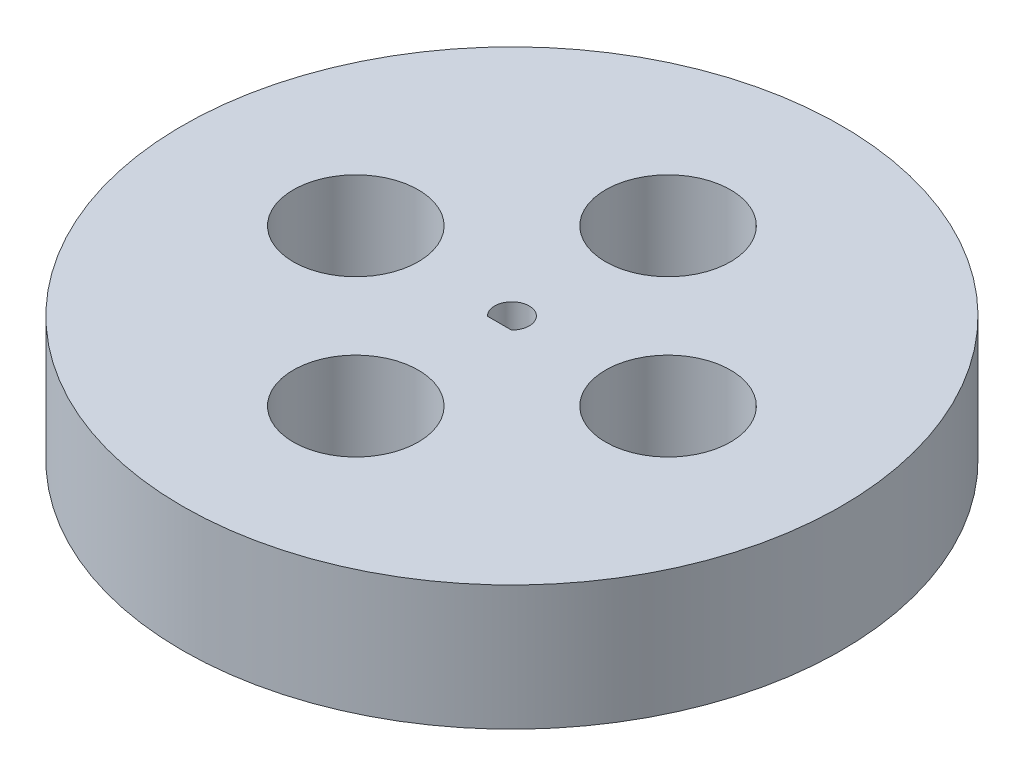
ISO-10303-21;
HEADER;
FILE_DESCRIPTION(('STEP AP214'),'2;1');
FILE_NAME('part.step','',(''),(''),'','','');
FILE_SCHEMA(('AUTOMOTIVE_DESIGN { 1 0 10303 214 1 1 1 1 }'));
ENDSEC;
DATA;
#1=APPLICATION_CONTEXT('core data for automotive mechanical design processes');
#2=APPLICATION_PROTOCOL_DEFINITION('international standard','automotive_design',2000,#1);
#3=PRODUCT_CONTEXT('',#1,'mechanical');
#4=PRODUCT('Part','Part','',(#3));
#5=PRODUCT_RELATED_PRODUCT_CATEGORY('part','',(#4));
#6=PRODUCT_DEFINITION_FORMATION('','',#4);
#7=PRODUCT_DEFINITION_CONTEXT('part definition',#1,'design');
#8=PRODUCT_DEFINITION('design','',#6,#7);
#9=PRODUCT_DEFINITION_SHAPE('','',#8);
#10=(LENGTH_UNIT() NAMED_UNIT(*) SI_UNIT(.MILLI.,.METRE.));
#11=(NAMED_UNIT(*) PLANE_ANGLE_UNIT() SI_UNIT($,.RADIAN.));
#12=(NAMED_UNIT(*) SI_UNIT($,.STERADIAN.) SOLID_ANGLE_UNIT());
#13=UNCERTAINTY_MEASURE_WITH_UNIT(LENGTH_MEASURE(1.E-05),#10,'distance_accuracy_value','');
#14=(GEOMETRIC_REPRESENTATION_CONTEXT(3) GLOBAL_UNCERTAINTY_ASSIGNED_CONTEXT((#13)) GLOBAL_UNIT_ASSIGNED_CONTEXT((#10,
#11,#12)) REPRESENTATION_CONTEXT('',''));
#15=CARTESIAN_POINT('',(0.,0.,0.));
#16=DIRECTION('',(0.,0.,1.));
#17=DIRECTION('',(1.,0.,0.));
#18=AXIS2_PLACEMENT_3D('',#15,#16,#17);
#19=CARTESIAN_POINT('',(0.,20.,0.));
#20=DIRECTION('',(0.,1.,0.));
#21=DIRECTION('',(0.,0.,1.));
#22=AXIS2_PLACEMENT_3D('',#19,#20,#21);
#23=PLANE('',#22);
#24=CARTESIAN_POINT('',(-25.,20.,0.));
#25=DIRECTION('',(0.,1.,0.));
#26=DIRECTION('',(0.,0.,1.));
#27=AXIS2_PLACEMENT_3D('',#24,#25,#26);
#28=CIRCLE('',#27,10.);
#29=CARTESIAN_POINT('',(-25.,20.,10.));
#30=VERTEX_POINT('',#29);
#31=EDGE_CURVE('E87',#30,#30,#28,.T.);
#32=ORIENTED_EDGE('',*,*,#31,.F.);
#33=EDGE_LOOP('',(#32));
#34=FACE_BOUND('',#33,.T.);
#35=CARTESIAN_POINT('',(0.,20.,-25.));
#36=DIRECTION('',(0.,1.,0.));
#37=DIRECTION('',(0.,0.,1.));
#38=AXIS2_PLACEMENT_3D('',#35,#36,#37);
#39=CIRCLE('',#38,10.);
#40=CARTESIAN_POINT('',(0.,20.,-15.));
#41=VERTEX_POINT('',#40);
#42=EDGE_CURVE('E109',#41,#41,#39,.T.);
#43=ORIENTED_EDGE('',*,*,#42,.F.);
#44=EDGE_LOOP('',(#43));
#45=FACE_BOUND('',#44,.T.);
#46=CARTESIAN_POINT('',(25.,20.,1.74574066942157E-13));
#47=DIRECTION('',(0.,1.,0.));
#48=DIRECTION('',(0.,0.,1.));
#49=AXIS2_PLACEMENT_3D('',#46,#47,#48);
#50=CIRCLE('',#49,10.);
#51=CARTESIAN_POINT('',(25.,20.,10.0000000000002));
#52=VERTEX_POINT('',#51);
#53=EDGE_CURVE('E103',#52,#52,#50,.T.);
#54=ORIENTED_EDGE('',*,*,#53,.F.);
#55=EDGE_LOOP('',(#54));
#56=FACE_BOUND('',#55,.T.);
#57=CARTESIAN_POINT('',(-2.61861100413235E-13,20.,25.));
#58=DIRECTION('',(0.,1.,0.));
#59=DIRECTION('',(0.,0.,1.));
#60=AXIS2_PLACEMENT_3D('',#57,#58,#59);
#61=CIRCLE('',#60,10.);
#62=CARTESIAN_POINT('',(-2.61861100413235E-13,20.,35.));
#63=VERTEX_POINT('',#62);
#64=EDGE_CURVE('E97',#63,#63,#61,.T.);
#65=ORIENTED_EDGE('',*,*,#64,.F.);
#66=EDGE_LOOP('',(#65));
#67=FACE_BOUND('',#66,.T.);
#68=CARTESIAN_POINT('',(0.,20.,0.));
#69=DIRECTION('',(0.,1.,0.));
#70=DIRECTION('',(0.,0.,1.));
#71=AXIS2_PLACEMENT_3D('',#68,#69,#70);
#72=CIRCLE('',#71,52.7712812921102);
#73=CARTESIAN_POINT('',(0.,20.,52.7712812921102));
#74=VERTEX_POINT('',#73);
#75=EDGE_CURVE('E12',#74,#74,#72,.T.);
#76=ORIENTED_EDGE('',*,*,#75,.T.);
#77=EDGE_LOOP('',(#76));
#78=FACE_BOUND('',#77,.T.);
#79=CARTESIAN_POINT('',(0.,20.,0.));
#80=DIRECTION('',(0.,1.,0.));
#81=DIRECTION('',(0.,0.,1.));
#82=AXIS2_PLACEMENT_3D('',#79,#80,#81);
#83=CIRCLE('',#82,2.7712812921102);
#84=CARTESIAN_POINT('',(1.91833260932509,20.,2.));
#85=VERTEX_POINT('',#84);
#86=CARTESIAN_POINT('',(-1.91833260932509,20.,2.));
#87=VERTEX_POINT('',#86);
#88=EDGE_CURVE('E90',#85,#87,#83,.T.);
#89=ORIENTED_EDGE('',*,*,#88,.F.);
#90=DIRECTION('',(1.,0.,0.));
#91=VECTOR('',#90,1.);
#92=CARTESIAN_POINT('',(0.,20.,2.));
#93=LINE('',#92,#91);
#94=EDGE_CURVE('E77',#87,#85,#93,.T.);
#95=ORIENTED_EDGE('',*,*,#94,.F.);
#96=EDGE_LOOP('',(#89,#95));
#97=FACE_BOUND('',#96,.T.);
#98=ADVANCED_FACE('F45',(#34,#45,#56,#67,#78,#97),#23,.T.);
#99=CARTESIAN_POINT('',(0.,0.,0.));
#100=DIRECTION('',(0.,1.,0.));
#101=DIRECTION('',(0.,0.,1.));
#102=AXIS2_PLACEMENT_3D('',#99,#100,#101);
#103=PLANE('',#102);
#104=CARTESIAN_POINT('',(-25.,0.,0.));
#105=DIRECTION('',(0.,1.,0.));
#106=DIRECTION('',(0.,0.,1.));
#107=AXIS2_PLACEMENT_3D('',#104,#105,#106);
#108=CIRCLE('',#107,10.);
#109=CARTESIAN_POINT('',(-25.,0.,10.));
#110=VERTEX_POINT('',#109);
#111=EDGE_CURVE('E84',#110,#110,#108,.T.);
#112=ORIENTED_EDGE('',*,*,#111,.T.);
#113=EDGE_LOOP('',(#112));
#114=FACE_BOUND('',#113,.T.);
#115=CARTESIAN_POINT('',(0.,0.,-25.));
#116=DIRECTION('',(0.,1.,0.));
#117=DIRECTION('',(0.,0.,1.));
#118=AXIS2_PLACEMENT_3D('',#115,#116,#117);
#119=CIRCLE('',#118,10.);
#120=CARTESIAN_POINT('',(0.,0.,-15.));
#121=VERTEX_POINT('',#120);
#122=EDGE_CURVE('E106',#121,#121,#119,.T.);
#123=ORIENTED_EDGE('',*,*,#122,.T.);
#124=EDGE_LOOP('',(#123));
#125=FACE_BOUND('',#124,.T.);
#126=CARTESIAN_POINT('',(25.,0.,1.74574066942157E-13));
#127=DIRECTION('',(0.,1.,0.));
#128=DIRECTION('',(0.,0.,1.));
#129=AXIS2_PLACEMENT_3D('',#126,#127,#128);
#130=CIRCLE('',#129,10.);
#131=CARTESIAN_POINT('',(25.,0.,10.0000000000002));
#132=VERTEX_POINT('',#131);
#133=EDGE_CURVE('E100',#132,#132,#130,.T.);
#134=ORIENTED_EDGE('',*,*,#133,.T.);
#135=EDGE_LOOP('',(#134));
#136=FACE_BOUND('',#135,.T.);
#137=CARTESIAN_POINT('',(-2.61861100413235E-13,0.,25.));
#138=DIRECTION('',(0.,1.,0.));
#139=DIRECTION('',(0.,0.,1.));
#140=AXIS2_PLACEMENT_3D('',#137,#138,#139);
#141=CIRCLE('',#140,10.);
#142=CARTESIAN_POINT('',(-2.61861100413235E-13,0.,35.));
#143=VERTEX_POINT('',#142);
#144=EDGE_CURVE('E94',#143,#143,#141,.T.);
#145=ORIENTED_EDGE('',*,*,#144,.T.);
#146=EDGE_LOOP('',(#145));
#147=FACE_BOUND('',#146,.T.);
#148=CARTESIAN_POINT('',(0.,0.,0.));
#149=DIRECTION('',(0.,1.,0.));
#150=DIRECTION('',(0.,0.,1.));
#151=AXIS2_PLACEMENT_3D('',#148,#149,#150);
#152=CIRCLE('',#151,52.7712812921102);
#153=CARTESIAN_POINT('',(0.,0.,52.7712812921102));
#154=VERTEX_POINT('',#153);
#155=EDGE_CURVE('E49',#154,#154,#152,.T.);
#156=ORIENTED_EDGE('',*,*,#155,.F.);
#157=EDGE_LOOP('',(#156));
#158=FACE_BOUND('',#157,.T.);
#159=DIRECTION('',(1.,0.,0.));
#160=VECTOR('',#159,1.);
#161=CARTESIAN_POINT('',(0.,0.,2.));
#162=LINE('',#161,#160);
#163=CARTESIAN_POINT('',(-1.91833260932509,0.,2.));
#164=VERTEX_POINT('',#163);
#165=CARTESIAN_POINT('',(1.91833260932509,0.,2.));
#166=VERTEX_POINT('',#165);
#167=EDGE_CURVE('E67',#164,#166,#162,.T.);
#168=ORIENTED_EDGE('',*,*,#167,.T.);
#169=CARTESIAN_POINT('',(0.,0.,0.));
#170=DIRECTION('',(0.,1.,0.));
#171=DIRECTION('',(0.,0.,1.));
#172=AXIS2_PLACEMENT_3D('',#169,#170,#171);
#173=CIRCLE('',#172,2.7712812921102);
#174=EDGE_CURVE('E73',#166,#164,#173,.T.);
#175=ORIENTED_EDGE('',*,*,#174,.T.);
#176=EDGE_LOOP('',(#168,#175));
#177=FACE_BOUND('',#176,.T.);
#178=ADVANCED_FACE('F83',(#114,#125,#136,#147,#158,#177),#103,.F.);
#179=CARTESIAN_POINT('',(0.,20.,0.));
#180=DIRECTION('',(0.,-1.,0.));
#181=DIRECTION('',(0.,0.,-1.));
#182=AXIS2_PLACEMENT_3D('',#179,#180,#181);
#183=CYLINDRICAL_SURFACE('',#182,52.7712812921102);
#184=ORIENTED_EDGE('',*,*,#75,.F.);
#185=EDGE_LOOP('',(#184));
#186=FACE_BOUND('',#185,.T.);
#187=ORIENTED_EDGE('',*,*,#155,.T.);
#188=EDGE_LOOP('',(#187));
#189=FACE_BOUND('',#188,.T.);
#190=ADVANCED_FACE('F47',(#186,#189),#183,.T.);
#191=CARTESIAN_POINT('',(0.,20.,2.));
#192=DIRECTION('',(0.,0.,-1.));
#193=DIRECTION('',(-1.,0.,0.));
#194=AXIS2_PLACEMENT_3D('',#191,#192,#193);
#195=PLANE('',#194);
#196=ORIENTED_EDGE('',*,*,#167,.F.);
#197=DIRECTION('',(0.,-1.,0.));
#198=VECTOR('',#197,1.);
#199=CARTESIAN_POINT('',(-1.91833260932509,20.,2.));
#200=LINE('',#199,#198);
#201=EDGE_CURVE('E75',#87,#164,#200,.T.);
#202=ORIENTED_EDGE('',*,*,#201,.F.);
#203=ORIENTED_EDGE('',*,*,#94,.T.);
#204=DIRECTION('',(0.,-1.,0.));
#205=VECTOR('',#204,1.);
#206=CARTESIAN_POINT('',(1.91833260932509,20.,2.));
#207=LINE('',#206,#205);
#208=EDGE_CURVE('E60',#85,#166,#207,.T.);
#209=ORIENTED_EDGE('',*,*,#208,.T.);
#210=EDGE_LOOP('',(#196,#202,#203,#209));
#211=FACE_BOUND('',#210,.T.);
#212=ADVANCED_FACE('F79',(#211),#195,.T.);
#213=CARTESIAN_POINT('',(0.,20.,0.));
#214=DIRECTION('',(0.,-1.,0.));
#215=DIRECTION('',(0.,0.,-1.));
#216=AXIS2_PLACEMENT_3D('',#213,#214,#215);
#217=CYLINDRICAL_SURFACE('',#216,2.7712812921102);
#218=ORIENTED_EDGE('',*,*,#174,.F.);
#219=ORIENTED_EDGE('',*,*,#208,.F.);
#220=ORIENTED_EDGE('',*,*,#88,.T.);
#221=ORIENTED_EDGE('',*,*,#201,.T.);
#222=EDGE_LOOP('',(#218,#219,#220,#221));
#223=FACE_BOUND('',#222,.T.);
#224=ADVANCED_FACE('F74',(#223),#217,.F.);
#225=CARTESIAN_POINT('',(-2.61861100413235E-13,0.,25.));
#226=DIRECTION('',(0.,1.,0.));
#227=DIRECTION('',(0.,0.,1.));
#228=AXIS2_PLACEMENT_3D('',#225,#226,#227);
#229=CYLINDRICAL_SURFACE('',#228,10.);
#230=ORIENTED_EDGE('',*,*,#144,.F.);
#231=EDGE_LOOP('',(#230));
#232=FACE_BOUND('',#231,.T.);
#233=ORIENTED_EDGE('',*,*,#64,.T.);
#234=EDGE_LOOP('',(#233));
#235=FACE_BOUND('',#234,.T.);
#236=ADVANCED_FACE('F144',(#232,#235),#229,.F.);
#237=CARTESIAN_POINT('',(25.,0.,1.74574066942157E-13));
#238=DIRECTION('',(0.,1.,0.));
#239=DIRECTION('',(0.,0.,1.));
#240=AXIS2_PLACEMENT_3D('',#237,#238,#239);
#241=CYLINDRICAL_SURFACE('',#240,10.);
#242=ORIENTED_EDGE('',*,*,#133,.F.);
#243=EDGE_LOOP('',(#242));
#244=FACE_BOUND('',#243,.T.);
#245=ORIENTED_EDGE('',*,*,#53,.T.);
#246=EDGE_LOOP('',(#245));
#247=FACE_BOUND('',#246,.T.);
#248=ADVANCED_FACE('F147',(#244,#247),#241,.F.);
#249=CARTESIAN_POINT('',(0.,0.,-25.));
#250=DIRECTION('',(0.,1.,0.));
#251=DIRECTION('',(0.,0.,1.));
#252=AXIS2_PLACEMENT_3D('',#249,#250,#251);
#253=CYLINDRICAL_SURFACE('',#252,10.);
#254=ORIENTED_EDGE('',*,*,#122,.F.);
#255=EDGE_LOOP('',(#254));
#256=FACE_BOUND('',#255,.T.);
#257=ORIENTED_EDGE('',*,*,#42,.T.);
#258=EDGE_LOOP('',(#257));
#259=FACE_BOUND('',#258,.T.);
#260=ADVANCED_FACE('F151',(#256,#259),#253,.F.);
#261=CARTESIAN_POINT('',(-25.,0.,0.));
#262=DIRECTION('',(0.,1.,0.));
#263=DIRECTION('',(0.,0.,1.));
#264=AXIS2_PLACEMENT_3D('',#261,#262,#263);
#265=CYLINDRICAL_SURFACE('',#264,10.);
#266=ORIENTED_EDGE('',*,*,#111,.F.);
#267=EDGE_LOOP('',(#266));
#268=FACE_BOUND('',#267,.T.);
#269=ORIENTED_EDGE('',*,*,#31,.T.);
#270=EDGE_LOOP('',(#269));
#271=FACE_BOUND('',#270,.T.);
#272=ADVANCED_FACE('F115',(#268,#271),#265,.F.);
#273=CLOSED_SHELL('',(#98,#178,#190,#212,#224,#236,#248,#260,#272));
#274=MANIFOLD_SOLID_BREP('B2',#273);
#275=ADVANCED_BREP_SHAPE_REPRESENTATION('',(#18,#274),#14);
#276=SHAPE_DEFINITION_REPRESENTATION(#9,#275);
ENDSEC;
END-ISO-10303-21;
